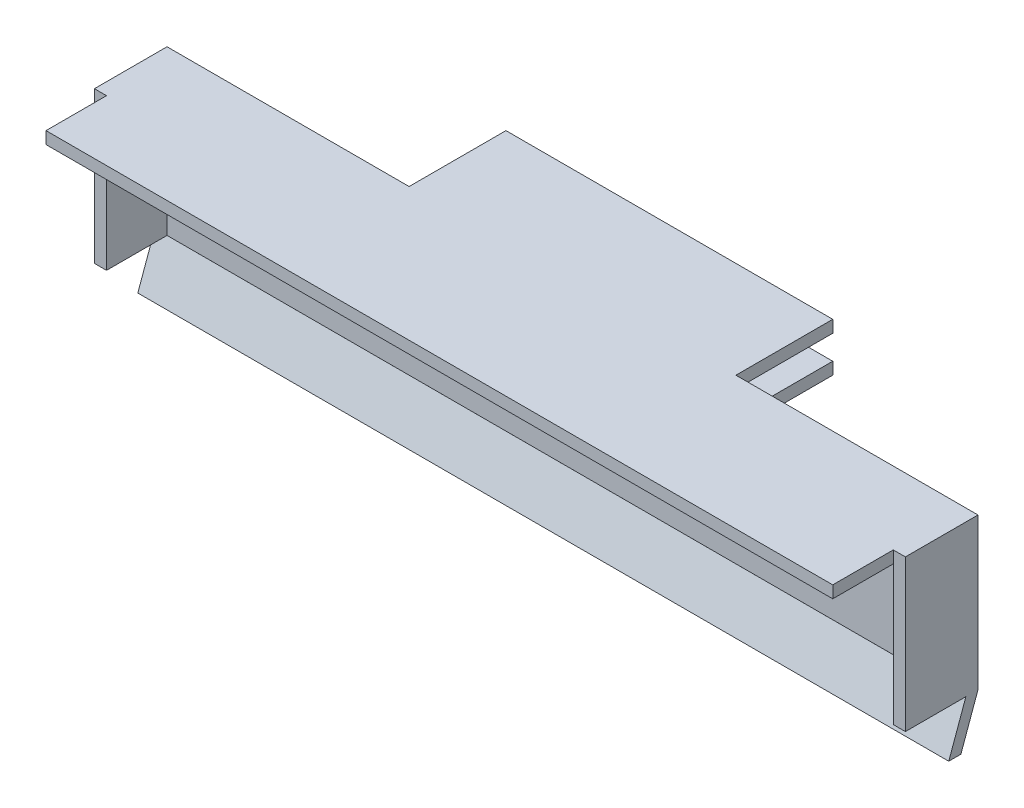
ISO-10303-21;
HEADER;
FILE_DESCRIPTION(('STEP AP214'),'2;1');
FILE_NAME('part.step','',(''),(''),'','','');
FILE_SCHEMA(('AUTOMOTIVE_DESIGN { 1 0 10303 214 1 1 1 1 }'));
ENDSEC;
DATA;
#1=APPLICATION_CONTEXT('core data for automotive mechanical design processes');
#2=APPLICATION_PROTOCOL_DEFINITION('international standard','automotive_design',2000,#1);
#3=PRODUCT_CONTEXT('',#1,'mechanical');
#4=PRODUCT('Part','Part','',(#3));
#5=PRODUCT_RELATED_PRODUCT_CATEGORY('part','',(#4));
#6=PRODUCT_DEFINITION_FORMATION('','',#4);
#7=PRODUCT_DEFINITION_CONTEXT('part definition',#1,'design');
#8=PRODUCT_DEFINITION('design','',#6,#7);
#9=PRODUCT_DEFINITION_SHAPE('','',#8);
#10=(LENGTH_UNIT() NAMED_UNIT(*) SI_UNIT(.MILLI.,.METRE.));
#11=(NAMED_UNIT(*) PLANE_ANGLE_UNIT() SI_UNIT($,.RADIAN.));
#12=(NAMED_UNIT(*) SI_UNIT($,.STERADIAN.) SOLID_ANGLE_UNIT());
#13=UNCERTAINTY_MEASURE_WITH_UNIT(LENGTH_MEASURE(1.E-05),#10,'distance_accuracy_value','');
#14=(GEOMETRIC_REPRESENTATION_CONTEXT(3) GLOBAL_UNCERTAINTY_ASSIGNED_CONTEXT((#13)) GLOBAL_UNIT_ASSIGNED_CONTEXT((#10,
#11,#12)) REPRESENTATION_CONTEXT('',''));
#15=CARTESIAN_POINT('',(0.,0.,0.));
#16=DIRECTION('',(0.,0.,1.));
#17=DIRECTION('',(1.,0.,0.));
#18=AXIS2_PLACEMENT_3D('',#15,#16,#17);
#19=CARTESIAN_POINT('',(0.,0.,6.));
#20=DIRECTION('',(0.,0.,-1.));
#21=DIRECTION('',(-1.,0.,0.));
#22=AXIS2_PLACEMENT_3D('',#19,#20,#21);
#23=PLANE('',#22);
#24=DIRECTION('',(0.,1.,0.));
#25=VECTOR('',#24,1.);
#26=CARTESIAN_POINT('',(-8.83057323703498,17.8823529411765,6.));
#27=LINE('',#26,#25);
#28=CARTESIAN_POINT('',(-8.83057323703498,17.8823529411765,6.));
#29=VERTEX_POINT('',#28);
#30=CARTESIAN_POINT('',(-8.83057323703498,18.8823529411765,6.));
#31=VERTEX_POINT('',#30);
#32=EDGE_CURVE('E37',#29,#31,#27,.T.);
#33=ORIENTED_EDGE('',*,*,#32,.F.);
#34=DIRECTION('',(0.,-1.,0.));
#35=VECTOR('',#34,1.);
#36=CARTESIAN_POINT('',(-8.83057323703498,17.8823529411765,6.));
#37=LINE('',#36,#35);
#38=CARTESIAN_POINT('',(-8.83057323703498,6.38235294117647,6.));
#39=VERTEX_POINT('',#38);
#40=EDGE_CURVE('E480',#29,#39,#37,.T.);
#41=ORIENTED_EDGE('',*,*,#40,.T.);
#42=DIRECTION('',(-1.,0.,0.));
#43=VECTOR('',#42,1.);
#44=CARTESIAN_POINT('',(-7.83057323703498,6.38235294117647,6.));
#45=LINE('',#44,#43);
#46=CARTESIAN_POINT('',(-7.83057323703498,6.38235294117647,6.));
#47=VERTEX_POINT('',#46);
#48=EDGE_CURVE('E467',#47,#39,#45,.T.);
#49=ORIENTED_EDGE('',*,*,#48,.F.);
#50=DIRECTION('',(0.,-1.,0.));
#51=VECTOR('',#50,1.);
#52=CARTESIAN_POINT('',(-7.83057323703498,18.8823529411765,6.));
#53=LINE('',#52,#51);
#54=CARTESIAN_POINT('',(-7.83057323703498,18.8823529411765,6.));
#55=VERTEX_POINT('',#54);
#56=EDGE_CURVE('E259',#55,#47,#53,.T.);
#57=ORIENTED_EDGE('',*,*,#56,.F.);
#58=DIRECTION('',(1.,0.,0.));
#59=VECTOR('',#58,1.);
#60=CARTESIAN_POINT('',(-7.83057323703498,18.8823529411765,6.));
#61=LINE('',#60,#59);
#62=EDGE_CURVE('E51',#31,#55,#61,.T.);
#63=ORIENTED_EDGE('',*,*,#62,.F.);
#64=EDGE_LOOP('',(#33,#41,#49,#57,#63));
#65=FACE_BOUND('',#64,.T.);
#66=ADVANCED_FACE('F33',(#65),#23,.F.);
#67=DIRECTION('',(0.,-1.,0.));
#68=VECTOR('',#67,1.);
#69=CARTESIAN_POINT('',(-73.830573237035,17.8823529411765,6.));
#70=LINE('',#69,#68);
#71=CARTESIAN_POINT('',(-73.830573237035,18.8823529411765,6.));
#72=VERTEX_POINT('',#71);
#73=CARTESIAN_POINT('',(-73.830573237035,17.8823529411765,6.));
#74=VERTEX_POINT('',#73);
#75=EDGE_CURVE('E59',#72,#74,#70,.T.);
#76=ORIENTED_EDGE('',*,*,#75,.F.);
#77=CARTESIAN_POINT('',(-74.830573237035,18.8823529411765,6.));
#78=VERTEX_POINT('',#77);
#79=EDGE_CURVE('E230',#78,#72,#61,.T.);
#80=ORIENTED_EDGE('',*,*,#79,.F.);
#81=DIRECTION('',(0.,1.,0.));
#82=VECTOR('',#81,1.);
#83=CARTESIAN_POINT('',(-74.830573237035,18.8823529411765,6.));
#84=LINE('',#83,#82);
#85=CARTESIAN_POINT('',(-74.830573237035,6.38235294117647,6.));
#86=VERTEX_POINT('',#85);
#87=EDGE_CURVE('E231',#86,#78,#84,.T.);
#88=ORIENTED_EDGE('',*,*,#87,.F.);
#89=CARTESIAN_POINT('',(-73.830573237035,6.38235294117647,6.));
#90=VERTEX_POINT('',#89);
#91=EDGE_CURVE('E466',#90,#86,#45,.T.);
#92=ORIENTED_EDGE('',*,*,#91,.F.);
#93=DIRECTION('',(0.,1.,0.));
#94=VECTOR('',#93,1.);
#95=CARTESIAN_POINT('',(-73.830573237035,17.8823529411765,6.));
#96=LINE('',#95,#94);
#97=EDGE_CURVE('E476',#90,#74,#96,.T.);
#98=ORIENTED_EDGE('',*,*,#97,.T.);
#99=EDGE_LOOP('',(#76,#80,#88,#92,#98));
#100=FACE_BOUND('',#99,.T.);
#101=ADVANCED_FACE('F339',(#100),#23,.F.);
#102=CARTESIAN_POINT('',(-7.83057323703498,6.38235294117647,6.));
#103=DIRECTION('',(0.,-1.,0.));
#104=DIRECTION('',(1.,0.,0.));
#105=AXIS2_PLACEMENT_3D('',#102,#103,#104);
#106=PLANE('',#105);
#107=DIRECTION('',(0.,0.,-1.));
#108=VECTOR('',#107,1.);
#109=CARTESIAN_POINT('',(-74.830573237035,6.38235294117647,6.));
#110=LINE('',#109,#108);
#111=CARTESIAN_POINT('',(-74.830573237035,6.38235294117648,1.00071514467714));
#112=VERTEX_POINT('',#111);
#113=EDGE_CURVE('E275',#86,#112,#110,.T.);
#114=ORIENTED_EDGE('',*,*,#113,.T.);
#115=DIRECTION('',(1.,0.,0.));
#116=VECTOR('',#115,1.);
#117=CARTESIAN_POINT('',(-74.830573237035,6.38235294117648,1.00071514467714));
#118=LINE('',#117,#116);
#119=CARTESIAN_POINT('',(-73.830573237035,6.38235294117648,1.00071514467714));
#120=VERTEX_POINT('',#119);
#121=EDGE_CURVE('E285',#112,#120,#118,.T.);
#122=ORIENTED_EDGE('',*,*,#121,.T.);
#123=DIRECTION('',(0.,0.,1.));
#124=VECTOR('',#123,1.);
#125=CARTESIAN_POINT('',(-73.830573237035,6.38235294117647,1.));
#126=LINE('',#125,#124);
#127=EDGE_CURVE('E319',#120,#90,#126,.T.);
#128=ORIENTED_EDGE('',*,*,#127,.T.);
#129=ORIENTED_EDGE('',*,*,#91,.T.);
#130=EDGE_LOOP('',(#114,#122,#128,#129));
#131=FACE_BOUND('',#130,.T.);
#132=ADVANCED_FACE('F344',(#131),#106,.T.);
#133=DIRECTION('',(0.,0.,1.));
#134=VECTOR('',#133,1.);
#135=CARTESIAN_POINT('',(-8.83057323703498,6.38235294117647,1.));
#136=LINE('',#135,#134);
#137=CARTESIAN_POINT('',(-8.83057323703498,6.38235294117647,1.00071514467714));
#138=VERTEX_POINT('',#137);
#139=EDGE_CURVE('E377',#138,#39,#136,.T.);
#140=ORIENTED_EDGE('',*,*,#139,.F.);
#141=CARTESIAN_POINT('',(-7.83057323703498,6.38235294117647,1.00071514467714));
#142=VERTEX_POINT('',#141);
#143=EDGE_CURVE('E11',#138,#142,#118,.T.);
#144=ORIENTED_EDGE('',*,*,#143,.T.);
#145=DIRECTION('',(0.,0.,-1.));
#146=VECTOR('',#145,1.);
#147=CARTESIAN_POINT('',(-7.83057323703498,6.38235294117647,6.));
#148=LINE('',#147,#146);
#149=EDGE_CURVE('E272',#47,#142,#148,.T.);
#150=ORIENTED_EDGE('',*,*,#149,.F.);
#151=ORIENTED_EDGE('',*,*,#48,.T.);
#152=EDGE_LOOP('',(#140,#144,#150,#151));
#153=FACE_BOUND('',#152,.T.);
#154=ADVANCED_FACE('F357',(#153),#106,.T.);
#155=CARTESIAN_POINT('',(0.,0.,0.));
#156=DIRECTION('',(0.,0.,1.));
#157=DIRECTION('',(1.,0.,0.));
#158=AXIS2_PLACEMENT_3D('',#155,#156,#157);
#159=PLANE('',#158);
#160=DIRECTION('',(0.,-1.,0.));
#161=VECTOR('',#160,1.);
#162=CARTESIAN_POINT('',(-27.830573237035,18.8823529411765,0.));
#163=LINE('',#162,#161);
#164=CARTESIAN_POINT('',(-27.830573237035,18.8823529411765,0.));
#165=VERTEX_POINT('',#164);
#166=CARTESIAN_POINT('',(-27.830573237035,17.8823529411765,0.));
#167=VERTEX_POINT('',#166);
#168=EDGE_CURVE('E414',#165,#167,#163,.T.);
#169=ORIENTED_EDGE('',*,*,#168,.F.);
#170=DIRECTION('',(1.,0.,0.));
#171=VECTOR('',#170,1.);
#172=CARTESIAN_POINT('',(-7.83057323703498,18.8823529411765,0.));
#173=LINE('',#172,#171);
#174=CARTESIAN_POINT('',(-7.83057323703498,18.8823529411765,0.));
#175=VERTEX_POINT('',#174);
#176=EDGE_CURVE('E248',#165,#175,#173,.T.);
#177=ORIENTED_EDGE('',*,*,#176,.T.);
#178=DIRECTION('',(0.,-1.,0.));
#179=VECTOR('',#178,1.);
#180=CARTESIAN_POINT('',(-7.83057323703498,18.8823529411765,0.));
#181=LINE('',#180,#179);
#182=CARTESIAN_POINT('',(-7.83057323703499,6.38235294117647,0.));
#183=VERTEX_POINT('',#182);
#184=EDGE_CURVE('E237',#175,#183,#181,.T.);
#185=ORIENTED_EDGE('',*,*,#184,.T.);
#186=DIRECTION('',(-1.,0.,0.));
#187=VECTOR('',#186,1.);
#188=CARTESIAN_POINT('',(-7.83057323703498,6.38235294117647,0.));
#189=LINE('',#188,#187);
#190=CARTESIAN_POINT('',(-74.830573237035,6.38235294117648,0.));
#191=VERTEX_POINT('',#190);
#192=EDGE_CURVE('E241',#183,#191,#189,.T.);
#193=ORIENTED_EDGE('',*,*,#192,.T.);
#194=DIRECTION('',(0.,1.,0.));
#195=VECTOR('',#194,1.);
#196=CARTESIAN_POINT('',(-74.830573237035,18.8823529411765,0.));
#197=LINE('',#196,#195);
#198=CARTESIAN_POINT('',(-74.830573237035,18.8823529411765,0.));
#199=VERTEX_POINT('',#198);
#200=EDGE_CURVE('E245',#191,#199,#197,.T.);
#201=ORIENTED_EDGE('',*,*,#200,.T.);
#202=CARTESIAN_POINT('',(-54.830573237035,18.8823529411765,0.));
#203=VERTEX_POINT('',#202);
#204=EDGE_CURVE('E257',#199,#203,#173,.T.);
#205=ORIENTED_EDGE('',*,*,#204,.T.);
#206=DIRECTION('',(0.,1.,0.));
#207=VECTOR('',#206,1.);
#208=CARTESIAN_POINT('',(-54.830573237035,18.8823529411765,0.));
#209=LINE('',#208,#207);
#210=CARTESIAN_POINT('',(-54.830573237035,17.8823529411765,0.));
#211=VERTEX_POINT('',#210);
#212=EDGE_CURVE('E419',#211,#203,#209,.T.);
#213=ORIENTED_EDGE('',*,*,#212,.F.);
#214=DIRECTION('',(-1.,0.,0.));
#215=VECTOR('',#214,1.);
#216=CARTESIAN_POINT('',(-27.830573237035,17.8823529411765,0.));
#217=LINE('',#216,#215);
#218=EDGE_CURVE('E426',#167,#211,#217,.T.);
#219=ORIENTED_EDGE('',*,*,#218,.F.);
#220=EDGE_LOOP('',(#169,#177,#185,#193,#201,#205,#213,#219));
#221=FACE_BOUND('',#220,.T.);
#222=DIRECTION('',(0.,-1.,0.));
#223=VECTOR('',#222,1.);
#224=CARTESIAN_POINT('',(-27.830573237035,15.8823529411765,0.));
#225=LINE('',#224,#223);
#226=CARTESIAN_POINT('',(-27.830573237035,15.8823529411765,0.));
#227=VERTEX_POINT('',#226);
#228=CARTESIAN_POINT('',(-27.830573237035,14.8823529411765,0.));
#229=VERTEX_POINT('',#228);
#230=EDGE_CURVE('E392',#227,#229,#225,.T.);
#231=ORIENTED_EDGE('',*,*,#230,.F.);
#232=DIRECTION('',(1.,0.,0.));
#233=VECTOR('',#232,1.);
#234=CARTESIAN_POINT('',(-27.830573237035,15.8823529411765,0.));
#235=LINE('',#234,#233);
#236=CARTESIAN_POINT('',(-54.830573237035,15.8823529411765,0.));
#237=VERTEX_POINT('',#236);
#238=EDGE_CURVE('E385',#237,#227,#235,.T.);
#239=ORIENTED_EDGE('',*,*,#238,.F.);
#240=DIRECTION('',(0.,1.,0.));
#241=VECTOR('',#240,1.);
#242=CARTESIAN_POINT('',(-54.830573237035,15.8823529411765,0.));
#243=LINE('',#242,#241);
#244=CARTESIAN_POINT('',(-54.830573237035,14.8823529411765,0.));
#245=VERTEX_POINT('',#244);
#246=EDGE_CURVE('E398',#245,#237,#243,.T.);
#247=ORIENTED_EDGE('',*,*,#246,.F.);
#248=DIRECTION('',(-1.,0.,0.));
#249=VECTOR('',#248,1.);
#250=CARTESIAN_POINT('',(-27.830573237035,14.8823529411765,0.));
#251=LINE('',#250,#249);
#252=EDGE_CURVE('E395',#229,#245,#251,.T.);
#253=ORIENTED_EDGE('',*,*,#252,.F.);
#254=EDGE_LOOP('',(#231,#239,#247,#253));
#255=FACE_BOUND('',#254,.T.);
#256=ADVANCED_FACE('F35',(#221,#255),#159,.F.);
#257=CARTESIAN_POINT('',(0.,0.,1.));
#258=DIRECTION('',(0.,0.,1.));
#259=DIRECTION('',(1.,0.,0.));
#260=AXIS2_PLACEMENT_3D('',#257,#258,#259);
#261=PLANE('',#260);
#262=DIRECTION('',(0.,-1.,0.));
#263=VECTOR('',#262,1.);
#264=CARTESIAN_POINT('',(-73.830573237035,17.8823529411765,1.));
#265=LINE('',#264,#263);
#266=CARTESIAN_POINT('',(-73.830573237035,17.8823529411765,1.));
#267=VERTEX_POINT('',#266);
#268=CARTESIAN_POINT('',(-73.830573237035,6.38235294117647,1.));
#269=VERTEX_POINT('',#268);
#270=EDGE_CURVE('E265',#267,#269,#265,.T.);
#271=ORIENTED_EDGE('',*,*,#270,.T.);
#272=DIRECTION('',(1.,0.,0.));
#273=VECTOR('',#272,1.);
#274=CARTESIAN_POINT('',(-8.83057323703498,6.38235294117647,1.));
#275=LINE('',#274,#273);
#276=CARTESIAN_POINT('',(-8.83057323703498,6.38235294117647,1.));
#277=VERTEX_POINT('',#276);
#278=EDGE_CURVE('E289',#269,#277,#275,.T.);
#279=ORIENTED_EDGE('',*,*,#278,.T.);
#280=DIRECTION('',(0.,1.,0.));
#281=VECTOR('',#280,1.);
#282=CARTESIAN_POINT('',(-8.83057323703498,17.8823529411765,1.));
#283=LINE('',#282,#281);
#284=CARTESIAN_POINT('',(-8.83057323703498,17.8823529411765,1.));
#285=VERTEX_POINT('',#284);
#286=EDGE_CURVE('E262',#277,#285,#283,.T.);
#287=ORIENTED_EDGE('',*,*,#286,.T.);
#288=DIRECTION('',(-1.,0.,0.));
#289=VECTOR('',#288,1.);
#290=CARTESIAN_POINT('',(-73.830573237035,17.8823529411765,1.));
#291=LINE('',#290,#289);
#292=EDGE_CURVE('E43',#285,#267,#291,.T.);
#293=ORIENTED_EDGE('',*,*,#292,.T.);
#294=EDGE_LOOP('',(#271,#279,#287,#293));
#295=FACE_BOUND('',#294,.T.);
#296=ADVANCED_FACE('F360',(#295),#261,.T.);
#297=CARTESIAN_POINT('',(-7.83057323703498,18.8823529411765,6.));
#298=DIRECTION('',(1.,0.,0.));
#299=DIRECTION('',(0.,1.,0.));
#300=AXIS2_PLACEMENT_3D('',#297,#298,#299);
#301=PLANE('',#300);
#302=ORIENTED_EDGE('',*,*,#184,.F.);
#303=DIRECTION('',(0.,0.,-1.));
#304=VECTOR('',#303,1.);
#305=CARTESIAN_POINT('',(-7.83057323703498,18.8823529411765,6.));
#306=LINE('',#305,#304);
#307=EDGE_CURVE('E251',#55,#175,#306,.T.);
#308=ORIENTED_EDGE('',*,*,#307,.F.);
#309=ORIENTED_EDGE('',*,*,#56,.T.);
#310=ORIENTED_EDGE('',*,*,#149,.T.);
#311=DIRECTION('',(0.,-0.940496505903131,0.339803358406007));
#312=VECTOR('',#311,1.);
#313=CARTESIAN_POINT('',(-7.83057323703499,6.38235294117647,1.00071514467714));
#314=LINE('',#313,#312);
#315=CARTESIAN_POINT('',(-7.83057323703499,2.46813937880338,2.41492870705024));
#316=VERTEX_POINT('',#315);
#317=EDGE_CURVE('E217',#142,#316,#314,.T.);
#318=ORIENTED_EDGE('',*,*,#317,.T.);
#319=DIRECTION('',(0.,0.,-1.));
#320=VECTOR('',#319,1.);
#321=CARTESIAN_POINT('',(-7.83057323703499,2.46813937880338,1.41421356237309));
#322=LINE('',#321,#320);
#323=CARTESIAN_POINT('',(-7.83057323703499,2.46813937880338,1.41421356237309));
#324=VERTEX_POINT('',#323);
#325=EDGE_CURVE('E305',#316,#324,#322,.T.);
#326=ORIENTED_EDGE('',*,*,#325,.T.);
#327=DIRECTION('',(0.,0.940496505903131,-0.339803358406007));
#328=VECTOR('',#327,1.);
#329=CARTESIAN_POINT('',(-7.83057323703499,6.38235294117647,0.));
#330=LINE('',#329,#328);
#331=EDGE_CURVE('E214',#324,#183,#330,.T.);
#332=ORIENTED_EDGE('',*,*,#331,.T.);
#333=EDGE_LOOP('',(#302,#308,#309,#310,#318,#326,#332));
#334=FACE_BOUND('',#333,.T.);
#335=ADVANCED_FACE('F324',(#334),#301,.T.);
#336=CARTESIAN_POINT('',(-7.83057323703498,18.8823529411765,6.));
#337=DIRECTION('',(0.,1.,0.));
#338=DIRECTION('',(0.,0.,1.));
#339=AXIS2_PLACEMENT_3D('',#336,#337,#338);
#340=PLANE('',#339);
#341=ORIENTED_EDGE('',*,*,#204,.F.);
#342=DIRECTION('',(0.,0.,-1.));
#343=VECTOR('',#342,1.);
#344=CARTESIAN_POINT('',(-74.830573237035,18.8823529411765,6.));
#345=LINE('',#344,#343);
#346=EDGE_CURVE('E460',#78,#199,#345,.T.);
#347=ORIENTED_EDGE('',*,*,#346,.F.);
#348=ORIENTED_EDGE('',*,*,#79,.T.);
#349=DIRECTION('',(0.,0.,-1.));
#350=VECTOR('',#349,1.);
#351=CARTESIAN_POINT('',(-73.830573237035,18.8823529411765,11.));
#352=LINE('',#351,#350);
#353=CARTESIAN_POINT('',(-73.830573237035,18.8823529411765,11.));
#354=VERTEX_POINT('',#353);
#355=EDGE_CURVE('E199',#354,#72,#352,.T.);
#356=ORIENTED_EDGE('',*,*,#355,.F.);
#357=DIRECTION('',(-1.,0.,0.));
#358=VECTOR('',#357,1.);
#359=CARTESIAN_POINT('',(-8.83057323703498,18.8823529411765,11.));
#360=LINE('',#359,#358);
#361=CARTESIAN_POINT('',(-8.83057323703498,18.8823529411765,11.));
#362=VERTEX_POINT('',#361);
#363=EDGE_CURVE('E191',#362,#354,#360,.T.);
#364=ORIENTED_EDGE('',*,*,#363,.F.);
#365=DIRECTION('',(0.,0.,-1.));
#366=VECTOR('',#365,1.);
#367=CARTESIAN_POINT('',(-8.83057323703498,18.8823529411765,11.));
#368=LINE('',#367,#366);
#369=EDGE_CURVE('E196',#362,#31,#368,.T.);
#370=ORIENTED_EDGE('',*,*,#369,.T.);
#371=ORIENTED_EDGE('',*,*,#62,.T.);
#372=ORIENTED_EDGE('',*,*,#307,.T.);
#373=ORIENTED_EDGE('',*,*,#176,.F.);
#374=DIRECTION('',(0.,0.,1.));
#375=VECTOR('',#374,1.);
#376=CARTESIAN_POINT('',(-27.830573237035,18.8823529411765,-8.));
#377=LINE('',#376,#375);
#378=CARTESIAN_POINT('',(-27.830573237035,18.8823529411765,-8.));
#379=VERTEX_POINT('',#378);
#380=EDGE_CURVE('E425',#379,#165,#377,.T.);
#381=ORIENTED_EDGE('',*,*,#380,.F.);
#382=DIRECTION('',(1.,0.,0.));
#383=VECTOR('',#382,1.);
#384=CARTESIAN_POINT('',(-27.830573237035,18.8823529411765,-8.));
#385=LINE('',#384,#383);
#386=CARTESIAN_POINT('',(-54.830573237035,18.8823529411765,-8.));
#387=VERTEX_POINT('',#386);
#388=EDGE_CURVE('E423',#387,#379,#385,.T.);
#389=ORIENTED_EDGE('',*,*,#388,.F.);
#390=DIRECTION('',(0.,0.,1.));
#391=VECTOR('',#390,1.);
#392=CARTESIAN_POINT('',(-54.830573237035,18.8823529411765,-8.));
#393=LINE('',#392,#391);
#394=EDGE_CURVE('E439',#387,#203,#393,.T.);
#395=ORIENTED_EDGE('',*,*,#394,.T.);
#396=EDGE_LOOP('',(#341,#347,#348,#356,#364,#370,#371,#372,#373,#381,#389,#395));
#397=FACE_BOUND('',#396,.T.);
#398=ADVANCED_FACE('F194',(#397),#340,.T.);
#399=CARTESIAN_POINT('',(-74.830573237035,18.8823529411765,6.));
#400=DIRECTION('',(-1.,0.,0.));
#401=DIRECTION('',(0.,0.,1.));
#402=AXIS2_PLACEMENT_3D('',#399,#400,#401);
#403=PLANE('',#402);
#404=ORIENTED_EDGE('',*,*,#200,.F.);
#405=DIRECTION('',(0.,0.940496505903131,-0.339803358406007));
#406=VECTOR('',#405,1.);
#407=CARTESIAN_POINT('',(-74.830573237035,6.38235294117648,0.));
#408=LINE('',#407,#406);
#409=CARTESIAN_POINT('',(-74.830573237035,2.46813937880339,1.41421356237309));
#410=VERTEX_POINT('',#409);
#411=EDGE_CURVE('E298',#410,#191,#408,.T.);
#412=ORIENTED_EDGE('',*,*,#411,.F.);
#413=DIRECTION('',(0.,0.,-1.));
#414=VECTOR('',#413,1.);
#415=CARTESIAN_POINT('',(-74.830573237035,2.46813937880339,1.41421356237309));
#416=LINE('',#415,#414);
#417=CARTESIAN_POINT('',(-74.830573237035,2.46813937880339,2.41492870705024));
#418=VERTEX_POINT('',#417);
#419=EDGE_CURVE('E286',#418,#410,#416,.T.);
#420=ORIENTED_EDGE('',*,*,#419,.F.);
#421=DIRECTION('',(0.,-0.940496505903131,0.339803358406007));
#422=VECTOR('',#421,1.);
#423=CARTESIAN_POINT('',(-74.830573237035,6.38235294117648,1.00071514467714));
#424=LINE('',#423,#422);
#425=EDGE_CURVE('E296',#112,#418,#424,.T.);
#426=ORIENTED_EDGE('',*,*,#425,.F.);
#427=ORIENTED_EDGE('',*,*,#113,.F.);
#428=ORIENTED_EDGE('',*,*,#87,.T.);
#429=ORIENTED_EDGE('',*,*,#346,.T.);
#430=EDGE_LOOP('',(#404,#412,#420,#426,#427,#428,#429));
#431=FACE_BOUND('',#430,.T.);
#432=ADVANCED_FACE('F351',(#431),#403,.T.);
#433=CARTESIAN_POINT('',(-8.83057323703498,17.8823529411765,6.));
#434=DIRECTION('',(1.,0.,0.));
#435=DIRECTION('',(0.,1.,0.));
#436=AXIS2_PLACEMENT_3D('',#433,#434,#435);
#437=PLANE('',#436);
#438=ORIENTED_EDGE('',*,*,#286,.F.);
#439=EDGE_CURVE('E379',#277,#138,#136,.T.);
#440=ORIENTED_EDGE('',*,*,#439,.T.);
#441=ORIENTED_EDGE('',*,*,#139,.T.);
#442=ORIENTED_EDGE('',*,*,#40,.F.);
#443=DIRECTION('',(0.,0.,-1.));
#444=VECTOR('',#443,1.);
#445=CARTESIAN_POINT('',(-8.83057323703498,17.8823529411765,6.));
#446=LINE('',#445,#444);
#447=EDGE_CURVE('E242',#29,#285,#446,.T.);
#448=ORIENTED_EDGE('',*,*,#447,.T.);
#449=EDGE_LOOP('',(#438,#440,#441,#442,#448));
#450=FACE_BOUND('',#449,.T.);
#451=ADVANCED_FACE('F347',(#450),#437,.F.);
#452=CARTESIAN_POINT('',(-8.83057323703498,17.8823529411765,6.));
#453=DIRECTION('',(0.,1.,0.));
#454=DIRECTION('',(0.,0.,1.));
#455=AXIS2_PLACEMENT_3D('',#452,#453,#454);
#456=PLANE('',#455);
#457=ORIENTED_EDGE('',*,*,#292,.F.);
#458=ORIENTED_EDGE('',*,*,#447,.F.);
#459=DIRECTION('',(0.,0.,-1.));
#460=VECTOR('',#459,1.);
#461=CARTESIAN_POINT('',(-8.83057323703498,17.8823529411765,11.));
#462=LINE('',#461,#460);
#463=CARTESIAN_POINT('',(-8.83057323703498,17.8823529411765,11.));
#464=VERTEX_POINT('',#463);
#465=EDGE_CURVE('E670',#464,#29,#462,.T.);
#466=ORIENTED_EDGE('',*,*,#465,.F.);
#467=DIRECTION('',(1.,0.,0.));
#468=VECTOR('',#467,1.);
#469=CARTESIAN_POINT('',(-8.83057323703498,17.8823529411765,11.));
#470=LINE('',#469,#468);
#471=CARTESIAN_POINT('',(-73.830573237035,17.8823529411765,11.));
#472=VERTEX_POINT('',#471);
#473=EDGE_CURVE('E208',#472,#464,#470,.T.);
#474=ORIENTED_EDGE('',*,*,#473,.F.);
#475=DIRECTION('',(0.,0.,-1.));
#476=VECTOR('',#475,1.);
#477=CARTESIAN_POINT('',(-73.830573237035,17.8823529411765,11.));
#478=LINE('',#477,#476);
#479=EDGE_CURVE('E219',#472,#74,#478,.T.);
#480=ORIENTED_EDGE('',*,*,#479,.T.);
#481=DIRECTION('',(0.,0.,-1.));
#482=VECTOR('',#481,1.);
#483=CARTESIAN_POINT('',(-73.830573237035,17.8823529411765,6.));
#484=LINE('',#483,#482);
#485=EDGE_CURVE('E474',#74,#267,#484,.T.);
#486=ORIENTED_EDGE('',*,*,#485,.T.);
#487=EDGE_LOOP('',(#457,#458,#466,#474,#480,#486));
#488=FACE_BOUND('',#487,.T.);
#489=ADVANCED_FACE('F503',(#488),#456,.F.);
#490=CARTESIAN_POINT('',(-73.830573237035,17.8823529411765,6.));
#491=DIRECTION('',(-1.,0.,0.));
#492=DIRECTION('',(0.,0.,1.));
#493=AXIS2_PLACEMENT_3D('',#490,#491,#492);
#494=PLANE('',#493);
#495=ORIENTED_EDGE('',*,*,#270,.F.);
#496=ORIENTED_EDGE('',*,*,#485,.F.);
#497=ORIENTED_EDGE('',*,*,#97,.F.);
#498=ORIENTED_EDGE('',*,*,#127,.F.);
#499=EDGE_CURVE('E372',#269,#120,#126,.T.);
#500=ORIENTED_EDGE('',*,*,#499,.F.);
#501=EDGE_LOOP('',(#495,#496,#497,#498,#500));
#502=FACE_BOUND('',#501,.T.);
#503=ADVANCED_FACE('F373',(#502),#494,.F.);
#504=CARTESIAN_POINT('',(-27.830573237035,18.8823529411765,-8.));
#505=DIRECTION('',(-1.,0.,0.));
#506=DIRECTION('',(0.,-1.,0.));
#507=AXIS2_PLACEMENT_3D('',#504,#505,#506);
#508=PLANE('',#507);
#509=ORIENTED_EDGE('',*,*,#168,.T.);
#510=DIRECTION('',(0.,0.,1.));
#511=VECTOR('',#510,1.);
#512=CARTESIAN_POINT('',(-27.830573237035,17.8823529411765,-8.));
#513=LINE('',#512,#511);
#514=CARTESIAN_POINT('',(-27.830573237035,17.8823529411765,-8.));
#515=VERTEX_POINT('',#514);
#516=EDGE_CURVE('E445',#515,#167,#513,.T.);
#517=ORIENTED_EDGE('',*,*,#516,.F.);
#518=DIRECTION('',(0.,-1.,0.));
#519=VECTOR('',#518,1.);
#520=CARTESIAN_POINT('',(-27.830573237035,18.8823529411765,-8.));
#521=LINE('',#520,#519);
#522=EDGE_CURVE('E415',#379,#515,#521,.T.);
#523=ORIENTED_EDGE('',*,*,#522,.F.);
#524=ORIENTED_EDGE('',*,*,#380,.T.);
#525=EDGE_LOOP('',(#509,#517,#523,#524));
#526=FACE_BOUND('',#525,.T.);
#527=ADVANCED_FACE('F454',(#526),#508,.F.);
#528=CARTESIAN_POINT('',(-27.830573237035,17.8823529411765,-8.));
#529=DIRECTION('',(0.,1.,0.));
#530=DIRECTION('',(0.,0.,1.));
#531=AXIS2_PLACEMENT_3D('',#528,#529,#530);
#532=PLANE('',#531);
#533=ORIENTED_EDGE('',*,*,#218,.T.);
#534=DIRECTION('',(0.,0.,1.));
#535=VECTOR('',#534,1.);
#536=CARTESIAN_POINT('',(-54.830573237035,17.8823529411765,-8.));
#537=LINE('',#536,#535);
#538=CARTESIAN_POINT('',(-54.830573237035,17.8823529411765,-8.));
#539=VERTEX_POINT('',#538);
#540=EDGE_CURVE('E431',#539,#211,#537,.T.);
#541=ORIENTED_EDGE('',*,*,#540,.F.);
#542=DIRECTION('',(-1.,0.,0.));
#543=VECTOR('',#542,1.);
#544=CARTESIAN_POINT('',(-27.830573237035,17.8823529411765,-8.));
#545=LINE('',#544,#543);
#546=EDGE_CURVE('E418',#515,#539,#545,.T.);
#547=ORIENTED_EDGE('',*,*,#546,.F.);
#548=ORIENTED_EDGE('',*,*,#516,.T.);
#549=EDGE_LOOP('',(#533,#541,#547,#548));
#550=FACE_BOUND('',#549,.T.);
#551=ADVANCED_FACE('F483',(#550),#532,.F.);
#552=CARTESIAN_POINT('',(-54.830573237035,18.8823529411765,-8.));
#553=DIRECTION('',(1.,0.,0.));
#554=DIRECTION('',(0.,0.,-1.));
#555=AXIS2_PLACEMENT_3D('',#552,#553,#554);
#556=PLANE('',#555);
#557=ORIENTED_EDGE('',*,*,#212,.T.);
#558=ORIENTED_EDGE('',*,*,#394,.F.);
#559=DIRECTION('',(0.,1.,0.));
#560=VECTOR('',#559,1.);
#561=CARTESIAN_POINT('',(-54.830573237035,18.8823529411765,-8.));
#562=LINE('',#561,#560);
#563=EDGE_CURVE('E421',#539,#387,#562,.T.);
#564=ORIENTED_EDGE('',*,*,#563,.F.);
#565=ORIENTED_EDGE('',*,*,#540,.T.);
#566=EDGE_LOOP('',(#557,#558,#564,#565));
#567=FACE_BOUND('',#566,.T.);
#568=ADVANCED_FACE('F489',(#567),#556,.F.);
#569=CARTESIAN_POINT('',(0.,0.,-8.));
#570=DIRECTION('',(0.,0.,-1.));
#571=DIRECTION('',(-1.,0.,0.));
#572=AXIS2_PLACEMENT_3D('',#569,#570,#571);
#573=PLANE('',#572);
#574=ORIENTED_EDGE('',*,*,#522,.T.);
#575=ORIENTED_EDGE('',*,*,#546,.T.);
#576=ORIENTED_EDGE('',*,*,#563,.T.);
#577=ORIENTED_EDGE('',*,*,#388,.T.);
#578=EDGE_LOOP('',(#574,#575,#576,#577));
#579=FACE_BOUND('',#578,.T.);
#580=ADVANCED_FACE('F487',(#579),#573,.T.);
#581=CARTESIAN_POINT('',(-27.830573237035,15.8823529411765,-8.));
#582=DIRECTION('',(-1.,0.,0.));
#583=DIRECTION('',(0.,0.,1.));
#584=AXIS2_PLACEMENT_3D('',#581,#582,#583);
#585=PLANE('',#584);
#586=ORIENTED_EDGE('',*,*,#230,.T.);
#587=DIRECTION('',(0.,0.,1.));
#588=VECTOR('',#587,1.);
#589=CARTESIAN_POINT('',(-27.830573237035,14.8823529411765,-8.));
#590=LINE('',#589,#588);
#591=CARTESIAN_POINT('',(-27.830573237035,14.8823529411765,-8.));
#592=VERTEX_POINT('',#591);
#593=EDGE_CURVE('E411',#592,#229,#590,.T.);
#594=ORIENTED_EDGE('',*,*,#593,.F.);
#595=DIRECTION('',(0.,-1.,0.));
#596=VECTOR('',#595,1.);
#597=CARTESIAN_POINT('',(-27.830573237035,15.8823529411765,-8.));
#598=LINE('',#597,#596);
#599=CARTESIAN_POINT('',(-27.830573237035,15.8823529411765,-8.));
#600=VERTEX_POINT('',#599);
#601=EDGE_CURVE('E381',#600,#592,#598,.T.);
#602=ORIENTED_EDGE('',*,*,#601,.F.);
#603=DIRECTION('',(0.,0.,1.));
#604=VECTOR('',#603,1.);
#605=CARTESIAN_POINT('',(-27.830573237035,15.8823529411765,-8.));
#606=LINE('',#605,#604);
#607=EDGE_CURVE('E391',#600,#227,#606,.T.);
#608=ORIENTED_EDGE('',*,*,#607,.T.);
#609=EDGE_LOOP('',(#586,#594,#602,#608));
#610=FACE_BOUND('',#609,.T.);
#611=ADVANCED_FACE('F496',(#610),#585,.F.);
#612=CARTESIAN_POINT('',(-27.830573237035,14.8823529411765,-8.));
#613=DIRECTION('',(0.,1.,0.));
#614=DIRECTION('',(0.,0.,1.));
#615=AXIS2_PLACEMENT_3D('',#612,#613,#614);
#616=PLANE('',#615);
#617=ORIENTED_EDGE('',*,*,#252,.T.);
#618=DIRECTION('',(0.,0.,1.));
#619=VECTOR('',#618,1.);
#620=CARTESIAN_POINT('',(-54.830573237035,14.8823529411765,-8.));
#621=LINE('',#620,#619);
#622=CARTESIAN_POINT('',(-54.830573237035,14.8823529411765,-8.));
#623=VERTEX_POINT('',#622);
#624=EDGE_CURVE('E408',#623,#245,#621,.T.);
#625=ORIENTED_EDGE('',*,*,#624,.F.);
#626=DIRECTION('',(-1.,0.,0.));
#627=VECTOR('',#626,1.);
#628=CARTESIAN_POINT('',(-27.830573237035,14.8823529411765,-8.));
#629=LINE('',#628,#627);
#630=EDGE_CURVE('E384',#592,#623,#629,.T.);
#631=ORIENTED_EDGE('',*,*,#630,.F.);
#632=ORIENTED_EDGE('',*,*,#593,.T.);
#633=EDGE_LOOP('',(#617,#625,#631,#632));
#634=FACE_BOUND('',#633,.T.);
#635=ADVANCED_FACE('F541',(#634),#616,.F.);
#636=CARTESIAN_POINT('',(-54.830573237035,15.8823529411765,-8.));
#637=DIRECTION('',(1.,0.,0.));
#638=DIRECTION('',(0.,0.,-1.));
#639=AXIS2_PLACEMENT_3D('',#636,#637,#638);
#640=PLANE('',#639);
#641=ORIENTED_EDGE('',*,*,#246,.T.);
#642=DIRECTION('',(0.,0.,1.));
#643=VECTOR('',#642,1.);
#644=CARTESIAN_POINT('',(-54.830573237035,15.8823529411765,-8.));
#645=LINE('',#644,#643);
#646=CARTESIAN_POINT('',(-54.830573237035,15.8823529411765,-8.));
#647=VERTEX_POINT('',#646);
#648=EDGE_CURVE('E405',#647,#237,#645,.T.);
#649=ORIENTED_EDGE('',*,*,#648,.F.);
#650=DIRECTION('',(0.,1.,0.));
#651=VECTOR('',#650,1.);
#652=CARTESIAN_POINT('',(-54.830573237035,15.8823529411765,-8.));
#653=LINE('',#652,#651);
#654=EDGE_CURVE('E387',#623,#647,#653,.T.);
#655=ORIENTED_EDGE('',*,*,#654,.F.);
#656=ORIENTED_EDGE('',*,*,#624,.T.);
#657=EDGE_LOOP('',(#641,#649,#655,#656));
#658=FACE_BOUND('',#657,.T.);
#659=ADVANCED_FACE('F550',(#658),#640,.F.);
#660=CARTESIAN_POINT('',(-27.830573237035,15.8823529411765,-8.));
#661=DIRECTION('',(0.,-1.,0.));
#662=DIRECTION('',(0.,0.,-1.));
#663=AXIS2_PLACEMENT_3D('',#660,#661,#662);
#664=PLANE('',#663);
#665=ORIENTED_EDGE('',*,*,#238,.T.);
#666=ORIENTED_EDGE('',*,*,#607,.F.);
#667=DIRECTION('',(1.,0.,0.));
#668=VECTOR('',#667,1.);
#669=CARTESIAN_POINT('',(-27.830573237035,15.8823529411765,-8.));
#670=LINE('',#669,#668);
#671=EDGE_CURVE('E389',#647,#600,#670,.T.);
#672=ORIENTED_EDGE('',*,*,#671,.F.);
#673=ORIENTED_EDGE('',*,*,#648,.T.);
#674=EDGE_LOOP('',(#665,#666,#672,#673));
#675=FACE_BOUND('',#674,.T.);
#676=ADVANCED_FACE('F560',(#675),#664,.F.);
#677=CARTESIAN_POINT('',(0.,0.,-8.));
#678=DIRECTION('',(0.,0.,-1.));
#679=DIRECTION('',(-1.,0.,0.));
#680=AXIS2_PLACEMENT_3D('',#677,#678,#679);
#681=PLANE('',#680);
#682=ORIENTED_EDGE('',*,*,#601,.T.);
#683=ORIENTED_EDGE('',*,*,#630,.T.);
#684=ORIENTED_EDGE('',*,*,#654,.T.);
#685=ORIENTED_EDGE('',*,*,#671,.T.);
#686=EDGE_LOOP('',(#682,#683,#684,#685));
#687=FACE_BOUND('',#686,.T.);
#688=ADVANCED_FACE('F570',(#687),#681,.T.);
#689=CARTESIAN_POINT('',(-74.830573237035,6.38235294117648,0.));
#690=DIRECTION('',(0.,1.,0.));
#691=DIRECTION('',(-1.,0.,0.));
#692=AXIS2_PLACEMENT_3D('',#689,#690,#691);
#693=PLANE('',#692);
#694=ORIENTED_EDGE('',*,*,#439,.F.);
#695=ORIENTED_EDGE('',*,*,#278,.F.);
#696=ORIENTED_EDGE('',*,*,#499,.T.);
#697=EDGE_CURVE('E280',#120,#138,#118,.T.);
#698=ORIENTED_EDGE('',*,*,#697,.T.);
#699=EDGE_LOOP('',(#694,#695,#696,#698));
#700=FACE_BOUND('',#699,.T.);
#701=ADVANCED_FACE('F335',(#700),#693,.T.);
#702=CARTESIAN_POINT('',(-74.830573237035,6.38235294117648,0.));
#703=DIRECTION('',(0.,-0.339803358406007,-0.940496505903131));
#704=DIRECTION('',(0.,0.940496505903131,-0.339803358406007));
#705=AXIS2_PLACEMENT_3D('',#702,#703,#704);
#706=PLANE('',#705);
#707=ORIENTED_EDGE('',*,*,#331,.F.);
#708=DIRECTION('',(1.,0.,0.));
#709=VECTOR('',#708,1.);
#710=CARTESIAN_POINT('',(-74.830573237035,2.46813937880339,1.41421356237309));
#711=LINE('',#710,#709);
#712=EDGE_CURVE('E314',#410,#324,#711,.T.);
#713=ORIENTED_EDGE('',*,*,#712,.F.);
#714=ORIENTED_EDGE('',*,*,#411,.T.);
#715=ORIENTED_EDGE('',*,*,#192,.F.);
#716=EDGE_LOOP('',(#707,#713,#714,#715));
#717=FACE_BOUND('',#716,.T.);
#718=ADVANCED_FACE('F328',(#717),#706,.T.);
#719=CARTESIAN_POINT('',(-74.830573237035,2.46813937880339,1.41421356237309));
#720=DIRECTION('',(0.,-1.,0.));
#721=DIRECTION('',(1.,0.,0.));
#722=AXIS2_PLACEMENT_3D('',#719,#720,#721);
#723=PLANE('',#722);
#724=ORIENTED_EDGE('',*,*,#325,.F.);
#725=DIRECTION('',(1.,0.,0.));
#726=VECTOR('',#725,1.);
#727=CARTESIAN_POINT('',(-74.830573237035,2.46813937880339,2.41492870705024));
#728=LINE('',#727,#726);
#729=EDGE_CURVE('E287',#418,#316,#728,.T.);
#730=ORIENTED_EDGE('',*,*,#729,.F.);
#731=ORIENTED_EDGE('',*,*,#419,.T.);
#732=ORIENTED_EDGE('',*,*,#712,.T.);
#733=EDGE_LOOP('',(#724,#730,#731,#732));
#734=FACE_BOUND('',#733,.T.);
#735=ADVANCED_FACE('F326',(#734),#723,.T.);
#736=CARTESIAN_POINT('',(-74.830573237035,6.38235294117648,1.00071514467714));
#737=DIRECTION('',(0.,0.339803358406007,0.940496505903131));
#738=DIRECTION('',(0.,-0.940496505903131,0.339803358406007));
#739=AXIS2_PLACEMENT_3D('',#736,#737,#738);
#740=PLANE('',#739);
#741=ORIENTED_EDGE('',*,*,#317,.F.);
#742=ORIENTED_EDGE('',*,*,#143,.F.);
#743=ORIENTED_EDGE('',*,*,#697,.F.);
#744=ORIENTED_EDGE('',*,*,#121,.F.);
#745=ORIENTED_EDGE('',*,*,#425,.T.);
#746=ORIENTED_EDGE('',*,*,#729,.T.);
#747=EDGE_LOOP('',(#741,#742,#743,#744,#745,#746));
#748=FACE_BOUND('',#747,.T.);
#749=ADVANCED_FACE('F321',(#748),#740,.T.);
#750=CARTESIAN_POINT('',(-8.83057323703498,17.8823529411765,11.));
#751=DIRECTION('',(-1.,0.,0.));
#752=DIRECTION('',(0.,0.,1.));
#753=AXIS2_PLACEMENT_3D('',#750,#751,#752);
#754=PLANE('',#753);
#755=ORIENTED_EDGE('',*,*,#32,.T.);
#756=ORIENTED_EDGE('',*,*,#369,.F.);
#757=DIRECTION('',(0.,1.,0.));
#758=VECTOR('',#757,1.);
#759=CARTESIAN_POINT('',(-8.83057323703498,17.8823529411765,11.));
#760=LINE('',#759,#758);
#761=EDGE_CURVE('E203',#464,#362,#760,.T.);
#762=ORIENTED_EDGE('',*,*,#761,.F.);
#763=ORIENTED_EDGE('',*,*,#465,.T.);
#764=EDGE_LOOP('',(#755,#756,#762,#763));
#765=FACE_BOUND('',#764,.T.);
#766=ADVANCED_FACE('F213',(#765),#754,.F.);
#767=CARTESIAN_POINT('',(-73.830573237035,17.8823529411765,11.));
#768=DIRECTION('',(1.,0.,0.));
#769=DIRECTION('',(0.,0.,-1.));
#770=AXIS2_PLACEMENT_3D('',#767,#768,#769);
#771=PLANE('',#770);
#772=ORIENTED_EDGE('',*,*,#75,.T.);
#773=ORIENTED_EDGE('',*,*,#479,.F.);
#774=DIRECTION('',(0.,-1.,0.));
#775=VECTOR('',#774,1.);
#776=CARTESIAN_POINT('',(-73.830573237035,17.8823529411765,11.));
#777=LINE('',#776,#775);
#778=EDGE_CURVE('E202',#354,#472,#777,.T.);
#779=ORIENTED_EDGE('',*,*,#778,.F.);
#780=ORIENTED_EDGE('',*,*,#355,.T.);
#781=EDGE_LOOP('',(#772,#773,#779,#780));
#782=FACE_BOUND('',#781,.T.);
#783=ADVANCED_FACE('F648',(#782),#771,.F.);
#784=CARTESIAN_POINT('',(0.,0.,11.));
#785=DIRECTION('',(0.,0.,1.));
#786=DIRECTION('',(1.,0.,0.));
#787=AXIS2_PLACEMENT_3D('',#784,#785,#786);
#788=PLANE('',#787);
#789=ORIENTED_EDGE('',*,*,#761,.T.);
#790=ORIENTED_EDGE('',*,*,#363,.T.);
#791=ORIENTED_EDGE('',*,*,#778,.T.);
#792=ORIENTED_EDGE('',*,*,#473,.T.);
#793=EDGE_LOOP('',(#789,#790,#791,#792));
#794=FACE_BOUND('',#793,.T.);
#795=ADVANCED_FACE('F206',(#794),#788,.T.);
#796=CLOSED_SHELL('',(#66,#101,#132,#154,#256,#296,#335,#398,#432,#451,#489,#503,#527,#551,#568,
#580,#611,#635,#659,#676,#688,#701,#718,#735,#749,#766,#783,#795));
#797=MANIFOLD_SOLID_BREP('B2',#796);
#798=ADVANCED_BREP_SHAPE_REPRESENTATION('',(#18,#797),#14);
#799=SHAPE_DEFINITION_REPRESENTATION(#9,#798);
ENDSEC;
END-ISO-10303-21;
